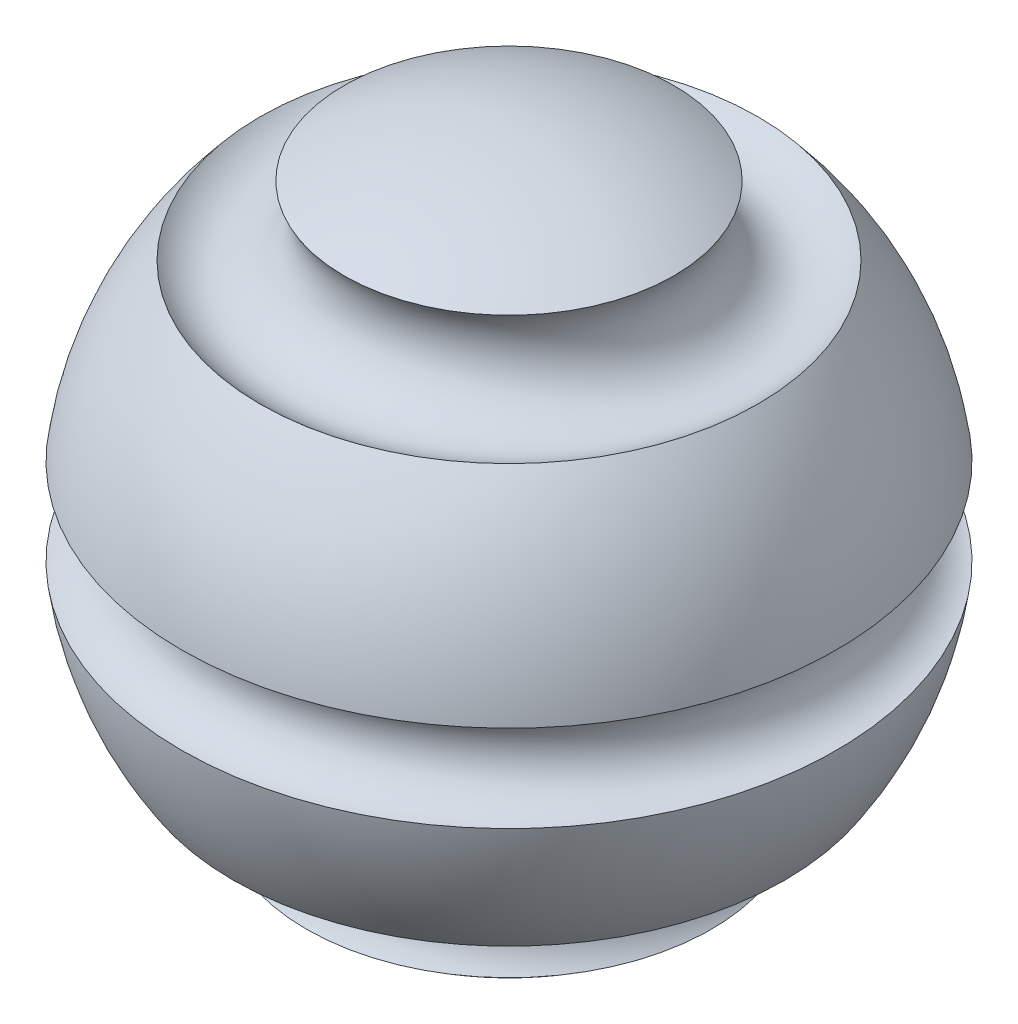
ISO-10303-21;
HEADER;
FILE_DESCRIPTION(('STEP AP214'),'2;1');
FILE_NAME('part.step','',(''),(''),'','','');
FILE_SCHEMA(('AUTOMOTIVE_DESIGN { 1 0 10303 214 1 1 1 1 }'));
ENDSEC;
DATA;
#1=APPLICATION_CONTEXT('core data for automotive mechanical design processes');
#2=APPLICATION_PROTOCOL_DEFINITION('international standard','automotive_design',2000,#1);
#3=PRODUCT_CONTEXT('',#1,'mechanical');
#4=PRODUCT('Part','Part','',(#3));
#5=PRODUCT_RELATED_PRODUCT_CATEGORY('part','',(#4));
#6=PRODUCT_DEFINITION_FORMATION('','',#4);
#7=PRODUCT_DEFINITION_CONTEXT('part definition',#1,'design');
#8=PRODUCT_DEFINITION('design','',#6,#7);
#9=PRODUCT_DEFINITION_SHAPE('','',#8);
#10=(LENGTH_UNIT() NAMED_UNIT(*) SI_UNIT(.MILLI.,.METRE.));
#11=(NAMED_UNIT(*) PLANE_ANGLE_UNIT() SI_UNIT($,.RADIAN.));
#12=(NAMED_UNIT(*) SI_UNIT($,.STERADIAN.) SOLID_ANGLE_UNIT());
#13=UNCERTAINTY_MEASURE_WITH_UNIT(LENGTH_MEASURE(1.E-05),#10,'distance_accuracy_value','');
#14=(GEOMETRIC_REPRESENTATION_CONTEXT(3) GLOBAL_UNCERTAINTY_ASSIGNED_CONTEXT((#13)) GLOBAL_UNIT_ASSIGNED_CONTEXT((#10,
#11,#12)) REPRESENTATION_CONTEXT('',''));
#15=CARTESIAN_POINT('',(0.,0.,0.));
#16=DIRECTION('',(0.,0.,1.));
#17=DIRECTION('',(1.,0.,0.));
#18=AXIS2_PLACEMENT_3D('',#15,#16,#17);
#19=CARTESIAN_POINT('',(0.,0.,0.));
#20=DIRECTION('',(0.,1.,0.));
#21=DIRECTION('',(1.,0.,0.));
#22=AXIS2_PLACEMENT_3D('',#19,#20,#21);
#23=SPHERICAL_SURFACE('',#22,10.);
#24=CARTESIAN_POINT('',(0.,8.66444703677804,0.));
#25=DIRECTION('',(0.,1.,0.));
#26=DIRECTION('',(0.,0.,1.));
#27=AXIS2_PLACEMENT_3D('',#24,#25,#26);
#28=CIRCLE('',#27,4.99273047008029);
#29=CARTESIAN_POINT('',(0.,8.66444703677804,4.99273047008029));
#30=VERTEX_POINT('',#29);
#31=EDGE_CURVE('E10',#30,#30,#28,.T.);
#32=ORIENTED_EDGE('',*,*,#31,.T.);
#33=EDGE_LOOP('',(#32));
#34=FACE_BOUND('',#33,.T.);
#35=ADVANCED_FACE('F41',(#34),#23,.T.);
#36=CARTESIAN_POINT('',(0.,7.72410729917138,0.));
#37=DIRECTION('',(0.,1.,0.));
#38=DIRECTION('',(0.,0.,1.));
#39=AXIS2_PLACEMENT_3D('',#36,#37,#38);
#40=TOROIDAL_SURFACE('',#39,6.3512334574386,1.65220131605794);
#41=CARTESIAN_POINT('',(0.,6.57291726040335,0.));
#42=DIRECTION('',(0.,1.,0.));
#43=DIRECTION('',(0.,0.,1.));
#44=AXIS2_PLACEMENT_3D('',#41,#42,#43);
#45=CIRCLE('',#44,7.53636243076802);
#46=CARTESIAN_POINT('',(0.,6.57291726040335,7.53636243076802));
#47=VERTEX_POINT('',#46);
#48=EDGE_CURVE('E48',#47,#47,#45,.T.);
#49=ORIENTED_EDGE('',*,*,#48,.T.);
#50=EDGE_LOOP('',(#49));
#51=FACE_BOUND('',#50,.T.);
#52=ORIENTED_EDGE('',*,*,#31,.F.);
#53=EDGE_LOOP('',(#52));
#54=FACE_BOUND('',#53,.T.);
#55=ADVANCED_FACE('F85',(#51,#54),#40,.F.);
#56=CARTESIAN_POINT('',(0.,0.,0.));
#57=DIRECTION('',(0.,1.,0.));
#58=DIRECTION('',(-1.,0.,0.));
#59=AXIS2_PLACEMENT_3D('',#56,#57,#58);
#60=SPHERICAL_SURFACE('',#59,10.);
#61=CARTESIAN_POINT('',(0.,1.31620190486166,0.));
#62=DIRECTION('',(0.,1.,0.));
#63=DIRECTION('',(0.,0.,1.));
#64=AXIS2_PLACEMENT_3D('',#61,#62,#63);
#65=CIRCLE('',#64,9.91300219639028);
#66=CARTESIAN_POINT('',(0.,1.31620190486166,9.91300219639028));
#67=VERTEX_POINT('',#66);
#68=EDGE_CURVE('E53',#67,#67,#65,.T.);
#69=ORIENTED_EDGE('',*,*,#68,.T.);
#70=EDGE_LOOP('',(#69));
#71=FACE_BOUND('',#70,.T.);
#72=ORIENTED_EDGE('',*,*,#48,.F.);
#73=EDGE_LOOP('',(#72));
#74=FACE_BOUND('',#73,.T.);
#75=ADVANCED_FACE('F89',(#71,#74),#60,.T.);
#76=CARTESIAN_POINT('',(0.,0.,0.));
#77=DIRECTION('',(0.,1.,0.));
#78=DIRECTION('',(0.,0.,1.));
#79=AXIS2_PLACEMENT_3D('',#76,#77,#78);
#80=TOROIDAL_SURFACE('',#79,10.,1.31907394493045);
#81=CARTESIAN_POINT('',(0.,-1.31620190486166,0.));
#82=DIRECTION('',(0.,1.,0.));
#83=DIRECTION('',(0.,0.,1.));
#84=AXIS2_PLACEMENT_3D('',#81,#82,#83);
#85=CIRCLE('',#84,9.91300219639028);
#86=CARTESIAN_POINT('',(0.,-1.31620190486166,9.91300219639028));
#87=VERTEX_POINT('',#86);
#88=EDGE_CURVE('E58',#87,#87,#85,.T.);
#89=ORIENTED_EDGE('',*,*,#88,.T.);
#90=EDGE_LOOP('',(#89));
#91=FACE_BOUND('',#90,.T.);
#92=ORIENTED_EDGE('',*,*,#68,.F.);
#93=EDGE_LOOP('',(#92));
#94=FACE_BOUND('',#93,.T.);
#95=ADVANCED_FACE('F93',(#91,#94),#80,.F.);
#96=CARTESIAN_POINT('',(0.,0.,0.));
#97=DIRECTION('',(0.,1.,0.));
#98=DIRECTION('',(-1.,0.,0.));
#99=AXIS2_PLACEMENT_3D('',#96,#97,#98);
#100=SPHERICAL_SURFACE('',#99,10.);
#101=CARTESIAN_POINT('',(0.,-5.50589646220638,0.));
#102=DIRECTION('',(0.,1.,0.));
#103=DIRECTION('',(0.,0.,1.));
#104=AXIS2_PLACEMENT_3D('',#101,#102,#103);
#105=CIRCLE('',#104,8.34776042705247);
#106=CARTESIAN_POINT('',(0.,-5.50589646220638,8.34776042705247));
#107=VERTEX_POINT('',#106);
#108=EDGE_CURVE('E64',#107,#107,#105,.T.);
#109=ORIENTED_EDGE('',*,*,#108,.T.);
#110=EDGE_LOOP('',(#109));
#111=FACE_BOUND('',#110,.T.);
#112=ORIENTED_EDGE('',*,*,#88,.F.);
#113=EDGE_LOOP('',(#112));
#114=FACE_BOUND('',#113,.T.);
#115=ADVANCED_FACE('F82',(#111,#114),#100,.T.);
#116=CARTESIAN_POINT('',(0.,-6.79546363295441,0.));
#117=DIRECTION('',(0.,1.,0.));
#118=DIRECTION('',(0.,0.,1.));
#119=AXIS2_PLACEMENT_3D('',#116,#117,#118);
#120=TOROIDAL_SURFACE('',#119,7.33632564797897,1.63889712922763);
#121=CARTESIAN_POINT('',(0.,-7.90250575137345,0.));
#122=DIRECTION('',(0.,1.,0.));
#123=DIRECTION('',(0.,0.,1.));
#124=AXIS2_PLACEMENT_3D('',#121,#122,#123);
#125=CIRCLE('',#124,6.12783835047153);
#126=CARTESIAN_POINT('',(0.,-7.90250575137345,6.12783835047153));
#127=VERTEX_POINT('',#126);
#128=EDGE_CURVE('E68',#127,#127,#125,.T.);
#129=ORIENTED_EDGE('',*,*,#128,.T.);
#130=EDGE_LOOP('',(#129));
#131=FACE_BOUND('',#130,.T.);
#132=ORIENTED_EDGE('',*,*,#108,.F.);
#133=EDGE_LOOP('',(#132));
#134=FACE_BOUND('',#133,.T.);
#135=ADVANCED_FACE('F73',(#131,#134),#120,.F.);
#136=CARTESIAN_POINT('',(0.,0.,0.));
#137=DIRECTION('',(0.,1.,0.));
#138=DIRECTION('',(-1.,0.,0.));
#139=AXIS2_PLACEMENT_3D('',#136,#137,#138);
#140=SPHERICAL_SURFACE('',#139,10.);
#141=ORIENTED_EDGE('',*,*,#128,.F.);
#142=EDGE_LOOP('',(#141));
#143=FACE_BOUND('',#142,.T.);
#144=ADVANCED_FACE('F76',(#143),#140,.T.);
#145=CLOSED_SHELL('',(#35,#55,#75,#95,#115,#135,#144));
#146=MANIFOLD_SOLID_BREP('B2',#145);
#147=ADVANCED_BREP_SHAPE_REPRESENTATION('',(#18,#146),#14);
#148=SHAPE_DEFINITION_REPRESENTATION(#9,#147);
ENDSEC;
END-ISO-10303-21;
